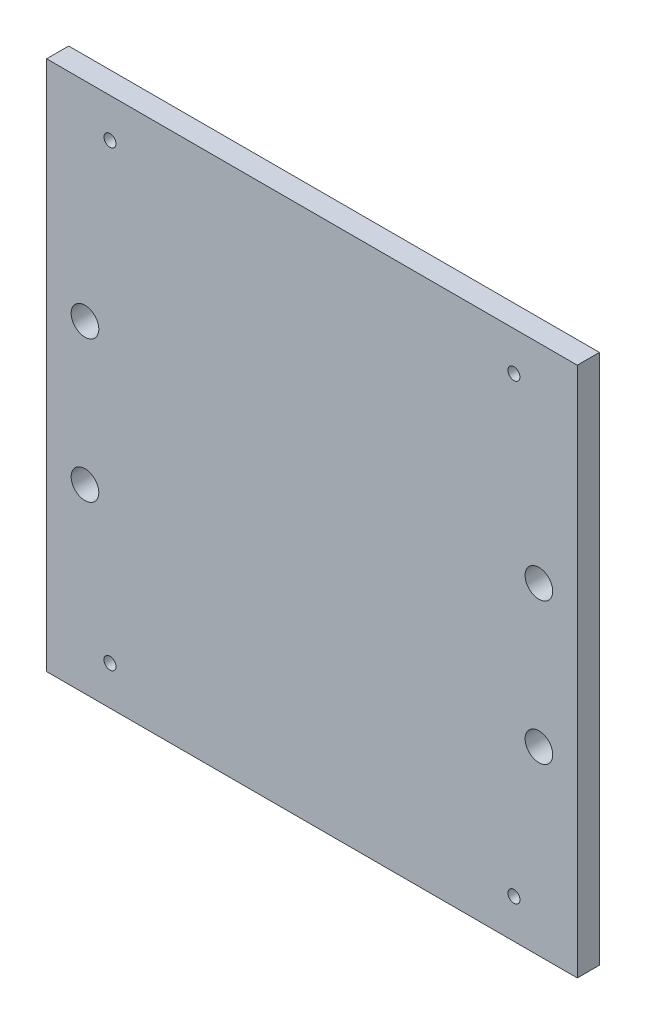
ISO-10303-21;
HEADER;
FILE_DESCRIPTION(('STEP AP214'),'2;1');
FILE_NAME('part.step','',(''),(''),'','','');
FILE_SCHEMA(('AUTOMOTIVE_DESIGN { 1 0 10303 214 1 1 1 1 }'));
ENDSEC;
DATA;
#1=APPLICATION_CONTEXT('core data for automotive mechanical design processes');
#2=APPLICATION_PROTOCOL_DEFINITION('international standard','automotive_design',2000,#1);
#3=PRODUCT_CONTEXT('',#1,'mechanical');
#4=PRODUCT('Part','Part','',(#3));
#5=PRODUCT_RELATED_PRODUCT_CATEGORY('part','',(#4));
#6=PRODUCT_DEFINITION_FORMATION('','',#4);
#7=PRODUCT_DEFINITION_CONTEXT('part definition',#1,'design');
#8=PRODUCT_DEFINITION('design','',#6,#7);
#9=PRODUCT_DEFINITION_SHAPE('','',#8);
#10=(LENGTH_UNIT() NAMED_UNIT(*) SI_UNIT(.MILLI.,.METRE.));
#11=(NAMED_UNIT(*) PLANE_ANGLE_UNIT() SI_UNIT($,.RADIAN.));
#12=(NAMED_UNIT(*) SI_UNIT($,.STERADIAN.) SOLID_ANGLE_UNIT());
#13=UNCERTAINTY_MEASURE_WITH_UNIT(LENGTH_MEASURE(1.E-05),#10,'distance_accuracy_value','');
#14=(GEOMETRIC_REPRESENTATION_CONTEXT(3) GLOBAL_UNCERTAINTY_ASSIGNED_CONTEXT((#13)) GLOBAL_UNIT_ASSIGNED_CONTEXT((#10,
#11,#12)) REPRESENTATION_CONTEXT('',''));
#15=CARTESIAN_POINT('',(0.,0.,0.));
#16=DIRECTION('',(0.,0.,1.));
#17=DIRECTION('',(1.,0.,0.));
#18=AXIS2_PLACEMENT_3D('',#15,#16,#17);
#19=CARTESIAN_POINT('',(76.2,36.8,6.35));
#20=DIRECTION('',(-1.,0.,0.));
#21=DIRECTION('',(0.,0.,1.));
#22=AXIS2_PLACEMENT_3D('',#19,#20,#21);
#23=PLANE('',#22);
#24=DIRECTION('',(0.,1.,0.));
#25=VECTOR('',#24,1.);
#26=CARTESIAN_POINT('',(76.2,36.8,0.));
#27=LINE('',#26,#25);
#28=CARTESIAN_POINT('',(76.2,36.8,0.));
#29=VERTEX_POINT('',#28);
#30=CARTESIAN_POINT('',(76.2,189.2,0.));
#31=VERTEX_POINT('',#30);
#32=EDGE_CURVE('E100',#29,#31,#27,.T.);
#33=ORIENTED_EDGE('',*,*,#32,.T.);
#34=DIRECTION('',(0.,0.,-1.));
#35=VECTOR('',#34,1.);
#36=CARTESIAN_POINT('',(76.2,189.2,6.35));
#37=LINE('',#36,#35);
#38=CARTESIAN_POINT('',(76.2,189.2,6.35));
#39=VERTEX_POINT('',#38);
#40=EDGE_CURVE('E11',#39,#31,#37,.T.);
#41=ORIENTED_EDGE('',*,*,#40,.F.);
#42=DIRECTION('',(0.,1.,0.));
#43=VECTOR('',#42,1.);
#44=CARTESIAN_POINT('',(76.2,36.8,6.35));
#45=LINE('',#44,#43);
#46=CARTESIAN_POINT('',(76.2,36.8,6.35));
#47=VERTEX_POINT('',#46);
#48=EDGE_CURVE('E88',#47,#39,#45,.T.);
#49=ORIENTED_EDGE('',*,*,#48,.F.);
#50=DIRECTION('',(0.,0.,-1.));
#51=VECTOR('',#50,1.);
#52=CARTESIAN_POINT('',(76.2,36.8,6.35));
#53=LINE('',#52,#51);
#54=EDGE_CURVE('E96',#47,#29,#53,.T.);
#55=ORIENTED_EDGE('',*,*,#54,.T.);
#56=EDGE_LOOP('',(#33,#41,#49,#55));
#57=FACE_BOUND('',#56,.T.);
#58=ADVANCED_FACE('F37',(#57),#23,.F.);
#59=CARTESIAN_POINT('',(-76.2,189.2,6.35));
#60=DIRECTION('',(0.,-1.,0.));
#61=DIRECTION('',(0.,0.,-1.));
#62=AXIS2_PLACEMENT_3D('',#59,#60,#61);
#63=PLANE('',#62);
#64=DIRECTION('',(-1.,0.,0.));
#65=VECTOR('',#64,1.);
#66=CARTESIAN_POINT('',(-76.2,189.2,0.));
#67=LINE('',#66,#65);
#68=CARTESIAN_POINT('',(-76.2,189.2,0.));
#69=VERTEX_POINT('',#68);
#70=EDGE_CURVE('E92',#31,#69,#67,.T.);
#71=ORIENTED_EDGE('',*,*,#70,.T.);
#72=DIRECTION('',(0.,0.,-1.));
#73=VECTOR('',#72,1.);
#74=CARTESIAN_POINT('',(-76.2,189.2,6.35));
#75=LINE('',#74,#73);
#76=CARTESIAN_POINT('',(-76.2,189.2,6.35));
#77=VERTEX_POINT('',#76);
#78=EDGE_CURVE('E45',#77,#69,#75,.T.);
#79=ORIENTED_EDGE('',*,*,#78,.F.);
#80=DIRECTION('',(-1.,0.,0.));
#81=VECTOR('',#80,1.);
#82=CARTESIAN_POINT('',(-76.2,189.2,6.35));
#83=LINE('',#82,#81);
#84=EDGE_CURVE('E83',#39,#77,#83,.T.);
#85=ORIENTED_EDGE('',*,*,#84,.F.);
#86=ORIENTED_EDGE('',*,*,#40,.T.);
#87=EDGE_LOOP('',(#71,#79,#85,#86));
#88=FACE_BOUND('',#87,.T.);
#89=ADVANCED_FACE('F91',(#88),#63,.F.);
#90=CARTESIAN_POINT('',(-76.2,36.8,6.35));
#91=DIRECTION('',(1.,0.,0.));
#92=DIRECTION('',(0.,0.,-1.));
#93=AXIS2_PLACEMENT_3D('',#90,#91,#92);
#94=PLANE('',#93);
#95=DIRECTION('',(0.,-1.,0.));
#96=VECTOR('',#95,1.);
#97=CARTESIAN_POINT('',(-76.2,36.8,0.));
#98=LINE('',#97,#96);
#99=CARTESIAN_POINT('',(-76.2,36.8,0.));
#100=VERTEX_POINT('',#99);
#101=EDGE_CURVE('E70',#69,#100,#98,.T.);
#102=ORIENTED_EDGE('',*,*,#101,.T.);
#103=DIRECTION('',(0.,0.,-1.));
#104=VECTOR('',#103,1.);
#105=CARTESIAN_POINT('',(-76.2,36.8,6.35));
#106=LINE('',#105,#104);
#107=CARTESIAN_POINT('',(-76.2,36.8,6.35));
#108=VERTEX_POINT('',#107);
#109=EDGE_CURVE('E93',#108,#100,#106,.T.);
#110=ORIENTED_EDGE('',*,*,#109,.F.);
#111=DIRECTION('',(0.,-1.,0.));
#112=VECTOR('',#111,1.);
#113=CARTESIAN_POINT('',(-76.2,36.8,6.35));
#114=LINE('',#113,#112);
#115=EDGE_CURVE('E86',#77,#108,#114,.T.);
#116=ORIENTED_EDGE('',*,*,#115,.F.);
#117=ORIENTED_EDGE('',*,*,#78,.T.);
#118=EDGE_LOOP('',(#102,#110,#116,#117));
#119=FACE_BOUND('',#118,.T.);
#120=ADVANCED_FACE('F94',(#119),#94,.F.);
#121=CARTESIAN_POINT('',(-76.2,36.8,6.35));
#122=DIRECTION('',(0.,1.,0.));
#123=DIRECTION('',(0.,0.,1.));
#124=AXIS2_PLACEMENT_3D('',#121,#122,#123);
#125=PLANE('',#124);
#126=DIRECTION('',(1.,0.,0.));
#127=VECTOR('',#126,1.);
#128=CARTESIAN_POINT('',(-76.2,36.8,0.));
#129=LINE('',#128,#127);
#130=EDGE_CURVE('E76',#100,#29,#129,.T.);
#131=ORIENTED_EDGE('',*,*,#130,.T.);
#132=ORIENTED_EDGE('',*,*,#54,.F.);
#133=DIRECTION('',(1.,0.,0.));
#134=VECTOR('',#133,1.);
#135=CARTESIAN_POINT('',(-76.2,36.8,6.35));
#136=LINE('',#135,#134);
#137=EDGE_CURVE('E53',#108,#47,#136,.T.);
#138=ORIENTED_EDGE('',*,*,#137,.F.);
#139=ORIENTED_EDGE('',*,*,#109,.T.);
#140=EDGE_LOOP('',(#131,#132,#138,#139));
#141=FACE_BOUND('',#140,.T.);
#142=ADVANCED_FACE('F108',(#141),#125,.F.);
#143=CARTESIAN_POINT('',(0.,0.,6.35));
#144=DIRECTION('',(0.,0.,-1.));
#145=DIRECTION('',(-1.,0.,0.));
#146=AXIS2_PLACEMENT_3D('',#143,#144,#145);
#147=PLANE('',#146);
#148=CARTESIAN_POINT('',(58.,178.,6.35));
#149=DIRECTION('',(0.,0.,-1.));
#150=DIRECTION('',(-1.,0.,0.));
#151=AXIS2_PLACEMENT_3D('',#148,#149,#150);
#152=CIRCLE('',#151,1.7272);
#153=CARTESIAN_POINT('',(56.2728,178.,6.35));
#154=VERTEX_POINT('',#153);
#155=EDGE_CURVE('E155',#154,#154,#152,.T.);
#156=ORIENTED_EDGE('',*,*,#155,.T.);
#157=EDGE_LOOP('',(#156));
#158=FACE_BOUND('',#157,.T.);
#159=CARTESIAN_POINT('',(-58.,178.,6.35));
#160=DIRECTION('',(0.,0.,-1.));
#161=DIRECTION('',(-1.,0.,0.));
#162=AXIS2_PLACEMENT_3D('',#159,#160,#161);
#163=CIRCLE('',#162,1.7272);
#164=CARTESIAN_POINT('',(-59.7272,178.,6.35));
#165=VERTEX_POINT('',#164);
#166=EDGE_CURVE('E149',#165,#165,#163,.T.);
#167=ORIENTED_EDGE('',*,*,#166,.T.);
#168=EDGE_LOOP('',(#167));
#169=FACE_BOUND('',#168,.T.);
#170=CARTESIAN_POINT('',(-58.,48.,6.35));
#171=DIRECTION('',(0.,0.,-1.));
#172=DIRECTION('',(-1.,0.,0.));
#173=AXIS2_PLACEMENT_3D('',#170,#171,#172);
#174=CIRCLE('',#173,1.7272);
#175=CARTESIAN_POINT('',(-59.7272,48.,6.35));
#176=VERTEX_POINT('',#175);
#177=EDGE_CURVE('E143',#176,#176,#174,.T.);
#178=ORIENTED_EDGE('',*,*,#177,.T.);
#179=EDGE_LOOP('',(#178));
#180=FACE_BOUND('',#179,.T.);
#181=CARTESIAN_POINT('',(58.,48.,6.35));
#182=DIRECTION('',(0.,0.,-1.));
#183=DIRECTION('',(-1.,0.,0.));
#184=AXIS2_PLACEMENT_3D('',#181,#182,#183);
#185=CIRCLE('',#184,1.7272);
#186=CARTESIAN_POINT('',(56.2728,48.,6.35));
#187=VERTEX_POINT('',#186);
#188=EDGE_CURVE('E137',#187,#187,#185,.T.);
#189=ORIENTED_EDGE('',*,*,#188,.T.);
#190=EDGE_LOOP('',(#189));
#191=FACE_BOUND('',#190,.T.);
#192=CARTESIAN_POINT('',(-65.1764000000047,88.8070000001298,6.35));
#193=DIRECTION('',(0.,0.,-1.));
#194=DIRECTION('',(-1.,0.,0.));
#195=AXIS2_PLACEMENT_3D('',#192,#193,#194);
#196=CIRCLE('',#195,3.96875);
#197=CARTESIAN_POINT('',(-69.1451500000047,88.8070000001298,6.35));
#198=VERTEX_POINT('',#197);
#199=EDGE_CURVE('E131',#198,#198,#196,.T.);
#200=ORIENTED_EDGE('',*,*,#199,.T.);
#201=EDGE_LOOP('',(#200));
#202=FACE_BOUND('',#201,.T.);
#203=CARTESIAN_POINT('',(-65.1764000000047,129.44700000013,6.35));
#204=DIRECTION('',(0.,0.,-1.));
#205=DIRECTION('',(-1.,0.,0.));
#206=AXIS2_PLACEMENT_3D('',#203,#204,#205);
#207=CIRCLE('',#206,3.96875);
#208=CARTESIAN_POINT('',(-69.1451500000047,129.44700000013,6.35));
#209=VERTEX_POINT('',#208);
#210=EDGE_CURVE('E125',#209,#209,#207,.T.);
#211=ORIENTED_EDGE('',*,*,#210,.T.);
#212=EDGE_LOOP('',(#211));
#213=FACE_BOUND('',#212,.T.);
#214=CARTESIAN_POINT('',(65.1764000000047,129.44700000013,6.35));
#215=DIRECTION('',(0.,0.,-1.));
#216=DIRECTION('',(-1.,0.,0.));
#217=AXIS2_PLACEMENT_3D('',#214,#215,#216);
#218=CIRCLE('',#217,3.96874999999999);
#219=CARTESIAN_POINT('',(61.2076500000047,129.44700000013,6.35));
#220=VERTEX_POINT('',#219);
#221=EDGE_CURVE('E119',#220,#220,#218,.T.);
#222=ORIENTED_EDGE('',*,*,#221,.T.);
#223=EDGE_LOOP('',(#222));
#224=FACE_BOUND('',#223,.T.);
#225=CARTESIAN_POINT('',(65.1764000000047,88.8070000001298,6.35));
#226=DIRECTION('',(0.,0.,-1.));
#227=DIRECTION('',(-1.,0.,0.));
#228=AXIS2_PLACEMENT_3D('',#225,#226,#227);
#229=CIRCLE('',#228,3.96874999999999);
#230=CARTESIAN_POINT('',(61.2076500000047,88.8070000001298,6.35));
#231=VERTEX_POINT('',#230);
#232=EDGE_CURVE('E103',#231,#231,#229,.T.);
#233=ORIENTED_EDGE('',*,*,#232,.T.);
#234=EDGE_LOOP('',(#233));
#235=FACE_BOUND('',#234,.T.);
#236=ORIENTED_EDGE('',*,*,#48,.T.);
#237=ORIENTED_EDGE('',*,*,#84,.T.);
#238=ORIENTED_EDGE('',*,*,#115,.T.);
#239=ORIENTED_EDGE('',*,*,#137,.T.);
#240=EDGE_LOOP('',(#236,#237,#238,#239));
#241=FACE_BOUND('',#240,.T.);
#242=ADVANCED_FACE('F84',(#158,#169,#180,#191,#202,#213,#224,#235,#241),#147,.F.);
#243=CARTESIAN_POINT('',(0.,0.,0.));
#244=DIRECTION('',(0.,0.,-1.));
#245=DIRECTION('',(-1.,0.,0.));
#246=AXIS2_PLACEMENT_3D('',#243,#244,#245);
#247=PLANE('',#246);
#248=CARTESIAN_POINT('',(58.,178.,0.));
#249=DIRECTION('',(0.,0.,-1.));
#250=DIRECTION('',(-1.,0.,0.));
#251=AXIS2_PLACEMENT_3D('',#248,#249,#250);
#252=CIRCLE('',#251,1.7272);
#253=CARTESIAN_POINT('',(56.2728,178.,0.));
#254=VERTEX_POINT('',#253);
#255=EDGE_CURVE('E158',#254,#254,#252,.T.);
#256=ORIENTED_EDGE('',*,*,#255,.F.);
#257=EDGE_LOOP('',(#256));
#258=FACE_BOUND('',#257,.T.);
#259=CARTESIAN_POINT('',(-58.,178.,0.));
#260=DIRECTION('',(0.,0.,-1.));
#261=DIRECTION('',(-1.,0.,0.));
#262=AXIS2_PLACEMENT_3D('',#259,#260,#261);
#263=CIRCLE('',#262,1.7272);
#264=CARTESIAN_POINT('',(-59.7272,178.,0.));
#265=VERTEX_POINT('',#264);
#266=EDGE_CURVE('E152',#265,#265,#263,.T.);
#267=ORIENTED_EDGE('',*,*,#266,.F.);
#268=EDGE_LOOP('',(#267));
#269=FACE_BOUND('',#268,.T.);
#270=CARTESIAN_POINT('',(-58.,48.,0.));
#271=DIRECTION('',(0.,0.,-1.));
#272=DIRECTION('',(-1.,0.,0.));
#273=AXIS2_PLACEMENT_3D('',#270,#271,#272);
#274=CIRCLE('',#273,1.7272);
#275=CARTESIAN_POINT('',(-59.7272,48.,0.));
#276=VERTEX_POINT('',#275);
#277=EDGE_CURVE('E146',#276,#276,#274,.T.);
#278=ORIENTED_EDGE('',*,*,#277,.F.);
#279=EDGE_LOOP('',(#278));
#280=FACE_BOUND('',#279,.T.);
#281=CARTESIAN_POINT('',(58.,48.,0.));
#282=DIRECTION('',(0.,0.,-1.));
#283=DIRECTION('',(-1.,0.,0.));
#284=AXIS2_PLACEMENT_3D('',#281,#282,#283);
#285=CIRCLE('',#284,1.7272);
#286=CARTESIAN_POINT('',(56.2728,48.,0.));
#287=VERTEX_POINT('',#286);
#288=EDGE_CURVE('E140',#287,#287,#285,.T.);
#289=ORIENTED_EDGE('',*,*,#288,.F.);
#290=EDGE_LOOP('',(#289));
#291=FACE_BOUND('',#290,.T.);
#292=CARTESIAN_POINT('',(-65.1764000000047,88.8070000001298,0.));
#293=DIRECTION('',(0.,0.,-1.));
#294=DIRECTION('',(-1.,0.,0.));
#295=AXIS2_PLACEMENT_3D('',#292,#293,#294);
#296=CIRCLE('',#295,3.96875);
#297=CARTESIAN_POINT('',(-69.1451500000047,88.8070000001298,0.));
#298=VERTEX_POINT('',#297);
#299=EDGE_CURVE('E134',#298,#298,#296,.T.);
#300=ORIENTED_EDGE('',*,*,#299,.F.);
#301=EDGE_LOOP('',(#300));
#302=FACE_BOUND('',#301,.T.);
#303=CARTESIAN_POINT('',(-65.1764000000047,129.44700000013,0.));
#304=DIRECTION('',(0.,0.,-1.));
#305=DIRECTION('',(-1.,0.,0.));
#306=AXIS2_PLACEMENT_3D('',#303,#304,#305);
#307=CIRCLE('',#306,3.96875);
#308=CARTESIAN_POINT('',(-69.1451500000047,129.44700000013,0.));
#309=VERTEX_POINT('',#308);
#310=EDGE_CURVE('E128',#309,#309,#307,.T.);
#311=ORIENTED_EDGE('',*,*,#310,.F.);
#312=EDGE_LOOP('',(#311));
#313=FACE_BOUND('',#312,.T.);
#314=CARTESIAN_POINT('',(65.1764000000047,129.44700000013,0.));
#315=DIRECTION('',(0.,0.,-1.));
#316=DIRECTION('',(-1.,0.,0.));
#317=AXIS2_PLACEMENT_3D('',#314,#315,#316);
#318=CIRCLE('',#317,3.96874999999999);
#319=CARTESIAN_POINT('',(61.2076500000047,129.44700000013,0.));
#320=VERTEX_POINT('',#319);
#321=EDGE_CURVE('E122',#320,#320,#318,.T.);
#322=ORIENTED_EDGE('',*,*,#321,.F.);
#323=EDGE_LOOP('',(#322));
#324=FACE_BOUND('',#323,.T.);
#325=CARTESIAN_POINT('',(65.1764000000047,88.8070000001298,0.));
#326=DIRECTION('',(0.,0.,-1.));
#327=DIRECTION('',(-1.,0.,0.));
#328=AXIS2_PLACEMENT_3D('',#325,#326,#327);
#329=CIRCLE('',#328,3.96874999999999);
#330=CARTESIAN_POINT('',(61.2076500000047,88.8070000001298,0.));
#331=VERTEX_POINT('',#330);
#332=EDGE_CURVE('E116',#331,#331,#329,.T.);
#333=ORIENTED_EDGE('',*,*,#332,.F.);
#334=EDGE_LOOP('',(#333));
#335=FACE_BOUND('',#334,.T.);
#336=ORIENTED_EDGE('',*,*,#32,.F.);
#337=ORIENTED_EDGE('',*,*,#130,.F.);
#338=ORIENTED_EDGE('',*,*,#101,.F.);
#339=ORIENTED_EDGE('',*,*,#70,.F.);
#340=EDGE_LOOP('',(#336,#337,#338,#339));
#341=FACE_BOUND('',#340,.T.);
#342=ADVANCED_FACE('F111',(#258,#269,#280,#291,#302,#313,#324,#335,#341),#247,.T.);
#343=CARTESIAN_POINT('',(65.1764000000047,88.8070000001298,0.));
#344=DIRECTION('',(0.,0.,-1.));
#345=DIRECTION('',(-1.,0.,0.));
#346=AXIS2_PLACEMENT_3D('',#343,#344,#345);
#347=CYLINDRICAL_SURFACE('',#346,3.96874999999999);
#348=ORIENTED_EDGE('',*,*,#232,.F.);
#349=EDGE_LOOP('',(#348));
#350=FACE_BOUND('',#349,.T.);
#351=ORIENTED_EDGE('',*,*,#332,.T.);
#352=EDGE_LOOP('',(#351));
#353=FACE_BOUND('',#352,.T.);
#354=ADVANCED_FACE('F166',(#350,#353),#347,.F.);
#355=CARTESIAN_POINT('',(65.1764000000047,129.44700000013,0.));
#356=DIRECTION('',(0.,0.,-1.));
#357=DIRECTION('',(-1.,0.,0.));
#358=AXIS2_PLACEMENT_3D('',#355,#356,#357);
#359=CYLINDRICAL_SURFACE('',#358,3.96874999999999);
#360=ORIENTED_EDGE('',*,*,#221,.F.);
#361=EDGE_LOOP('',(#360));
#362=FACE_BOUND('',#361,.T.);
#363=ORIENTED_EDGE('',*,*,#321,.T.);
#364=EDGE_LOOP('',(#363));
#365=FACE_BOUND('',#364,.T.);
#366=ADVANCED_FACE('F183',(#362,#365),#359,.F.);
#367=CARTESIAN_POINT('',(-65.1764000000047,129.44700000013,0.));
#368=DIRECTION('',(0.,0.,-1.));
#369=DIRECTION('',(-1.,0.,0.));
#370=AXIS2_PLACEMENT_3D('',#367,#368,#369);
#371=CYLINDRICAL_SURFACE('',#370,3.96875);
#372=ORIENTED_EDGE('',*,*,#210,.F.);
#373=EDGE_LOOP('',(#372));
#374=FACE_BOUND('',#373,.T.);
#375=ORIENTED_EDGE('',*,*,#310,.T.);
#376=EDGE_LOOP('',(#375));
#377=FACE_BOUND('',#376,.T.);
#378=ADVANCED_FACE('F189',(#374,#377),#371,.F.);
#379=CARTESIAN_POINT('',(-65.1764000000047,88.8070000001298,0.));
#380=DIRECTION('',(0.,0.,-1.));
#381=DIRECTION('',(-1.,0.,0.));
#382=AXIS2_PLACEMENT_3D('',#379,#380,#381);
#383=CYLINDRICAL_SURFACE('',#382,3.96875);
#384=ORIENTED_EDGE('',*,*,#199,.F.);
#385=EDGE_LOOP('',(#384));
#386=FACE_BOUND('',#385,.T.);
#387=ORIENTED_EDGE('',*,*,#299,.T.);
#388=EDGE_LOOP('',(#387));
#389=FACE_BOUND('',#388,.T.);
#390=ADVANCED_FACE('F226',(#386,#389),#383,.F.);
#391=CARTESIAN_POINT('',(58.,48.,0.));
#392=DIRECTION('',(0.,0.,-1.));
#393=DIRECTION('',(-1.,0.,0.));
#394=AXIS2_PLACEMENT_3D('',#391,#392,#393);
#395=CYLINDRICAL_SURFACE('',#394,1.7272);
#396=ORIENTED_EDGE('',*,*,#188,.F.);
#397=EDGE_LOOP('',(#396));
#398=FACE_BOUND('',#397,.T.);
#399=ORIENTED_EDGE('',*,*,#288,.T.);
#400=EDGE_LOOP('',(#399));
#401=FACE_BOUND('',#400,.T.);
#402=ADVANCED_FACE('F231',(#398,#401),#395,.F.);
#403=CARTESIAN_POINT('',(-58.,48.,0.));
#404=DIRECTION('',(0.,0.,-1.));
#405=DIRECTION('',(-1.,0.,0.));
#406=AXIS2_PLACEMENT_3D('',#403,#404,#405);
#407=CYLINDRICAL_SURFACE('',#406,1.7272);
#408=ORIENTED_EDGE('',*,*,#177,.F.);
#409=EDGE_LOOP('',(#408));
#410=FACE_BOUND('',#409,.T.);
#411=ORIENTED_EDGE('',*,*,#277,.T.);
#412=EDGE_LOOP('',(#411));
#413=FACE_BOUND('',#412,.T.);
#414=ADVANCED_FACE('F237',(#410,#413),#407,.F.);
#415=CARTESIAN_POINT('',(-58.,178.,0.));
#416=DIRECTION('',(0.,0.,-1.));
#417=DIRECTION('',(-1.,0.,0.));
#418=AXIS2_PLACEMENT_3D('',#415,#416,#417);
#419=CYLINDRICAL_SURFACE('',#418,1.7272);
#420=ORIENTED_EDGE('',*,*,#166,.F.);
#421=EDGE_LOOP('',(#420));
#422=FACE_BOUND('',#421,.T.);
#423=ORIENTED_EDGE('',*,*,#266,.T.);
#424=EDGE_LOOP('',(#423));
#425=FACE_BOUND('',#424,.T.);
#426=ADVANCED_FACE('F241',(#422,#425),#419,.F.);
#427=CARTESIAN_POINT('',(58.,178.,0.));
#428=DIRECTION('',(0.,0.,-1.));
#429=DIRECTION('',(-1.,0.,0.));
#430=AXIS2_PLACEMENT_3D('',#427,#428,#429);
#431=CYLINDRICAL_SURFACE('',#430,1.7272);
#432=ORIENTED_EDGE('',*,*,#155,.F.);
#433=EDGE_LOOP('',(#432));
#434=FACE_BOUND('',#433,.T.);
#435=ORIENTED_EDGE('',*,*,#255,.T.);
#436=EDGE_LOOP('',(#435));
#437=FACE_BOUND('',#436,.T.);
#438=ADVANCED_FACE('F162',(#434,#437),#431,.F.);
#439=CLOSED_SHELL('',(#58,#89,#120,#142,#242,#342,#354,#366,#378,#390,#402,#414,#426,#438));
#440=MANIFOLD_SOLID_BREP('B2',#439);
#441=ADVANCED_BREP_SHAPE_REPRESENTATION('',(#18,#440),#14);
#442=SHAPE_DEFINITION_REPRESENTATION(#9,#441);
ENDSEC;
END-ISO-10303-21;
